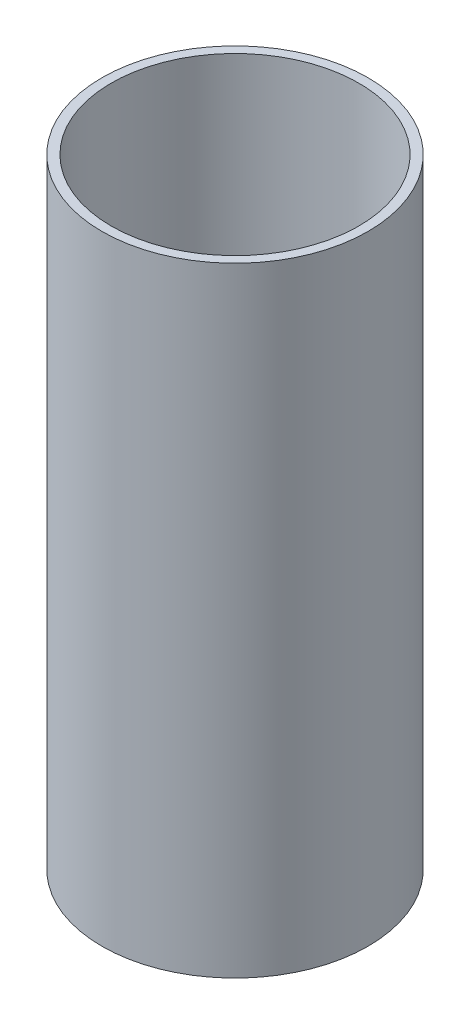
ISO-10303-21;
HEADER;
FILE_DESCRIPTION(('STEP AP214'),'2;1');
FILE_NAME('part.step','',(''),(''),'','','');
FILE_SCHEMA(('AUTOMOTIVE_DESIGN { 1 0 10303 214 1 1 1 1 }'));
ENDSEC;
DATA;
#1=APPLICATION_CONTEXT('core data for automotive mechanical design processes');
#2=APPLICATION_PROTOCOL_DEFINITION('international standard','automotive_design',2000,#1);
#3=PRODUCT_CONTEXT('',#1,'mechanical');
#4=PRODUCT('Part','Part','',(#3));
#5=PRODUCT_RELATED_PRODUCT_CATEGORY('part','',(#4));
#6=PRODUCT_DEFINITION_FORMATION('','',#4);
#7=PRODUCT_DEFINITION_CONTEXT('part definition',#1,'design');
#8=PRODUCT_DEFINITION('design','',#6,#7);
#9=PRODUCT_DEFINITION_SHAPE('','',#8);
#10=(LENGTH_UNIT() NAMED_UNIT(*) SI_UNIT(.MILLI.,.METRE.));
#11=(NAMED_UNIT(*) PLANE_ANGLE_UNIT() SI_UNIT($,.RADIAN.));
#12=(NAMED_UNIT(*) SI_UNIT($,.STERADIAN.) SOLID_ANGLE_UNIT());
#13=UNCERTAINTY_MEASURE_WITH_UNIT(LENGTH_MEASURE(1.E-05),#10,'distance_accuracy_value','');
#14=(GEOMETRIC_REPRESENTATION_CONTEXT(3) GLOBAL_UNCERTAINTY_ASSIGNED_CONTEXT((#13)) GLOBAL_UNIT_ASSIGNED_CONTEXT((#10,
#11,#12)) REPRESENTATION_CONTEXT('',''));
#15=CARTESIAN_POINT('',(0.,0.,0.));
#16=DIRECTION('',(0.,0.,1.));
#17=DIRECTION('',(1.,0.,0.));
#18=AXIS2_PLACEMENT_3D('',#15,#16,#17);
#19=CARTESIAN_POINT('',(0.,127.,0.));
#20=DIRECTION('',(0.,1.,0.));
#21=DIRECTION('',(0.,0.,1.));
#22=AXIS2_PLACEMENT_3D('',#19,#20,#21);
#23=PLANE('',#22);
#24=CARTESIAN_POINT('',(0.,127.,0.));
#25=DIRECTION('',(0.,1.,0.));
#26=DIRECTION('',(0.,0.,1.));
#27=AXIS2_PLACEMENT_3D('',#24,#25,#26);
#28=CIRCLE('',#27,27.305);
#29=CARTESIAN_POINT('',(0.,127.,27.305));
#30=VERTEX_POINT('',#29);
#31=EDGE_CURVE('E10',#30,#30,#28,.T.);
#32=ORIENTED_EDGE('',*,*,#31,.T.);
#33=EDGE_LOOP('',(#32));
#34=FACE_BOUND('',#33,.T.);
#35=CARTESIAN_POINT('',(0.,127.,0.));
#36=DIRECTION('',(0.,1.,0.));
#37=DIRECTION('',(0.,0.,1.));
#38=AXIS2_PLACEMENT_3D('',#35,#36,#37);
#39=CIRCLE('',#38,25.4);
#40=CARTESIAN_POINT('',(0.,127.,25.4));
#41=VERTEX_POINT('',#40);
#42=EDGE_CURVE('E45',#41,#41,#39,.T.);
#43=ORIENTED_EDGE('',*,*,#42,.F.);
#44=EDGE_LOOP('',(#43));
#45=FACE_BOUND('',#44,.T.);
#46=ADVANCED_FACE('F34',(#34,#45),#23,.T.);
#47=CARTESIAN_POINT('',(0.,0.,0.));
#48=DIRECTION('',(0.,1.,0.));
#49=DIRECTION('',(0.,0.,1.));
#50=AXIS2_PLACEMENT_3D('',#47,#48,#49);
#51=PLANE('',#50);
#52=CARTESIAN_POINT('',(0.,0.,0.));
#53=DIRECTION('',(0.,1.,0.));
#54=DIRECTION('',(0.,0.,1.));
#55=AXIS2_PLACEMENT_3D('',#52,#53,#54);
#56=CIRCLE('',#55,27.305);
#57=CARTESIAN_POINT('',(0.,0.,27.305));
#58=VERTEX_POINT('',#57);
#59=EDGE_CURVE('E38',#58,#58,#56,.T.);
#60=ORIENTED_EDGE('',*,*,#59,.F.);
#61=EDGE_LOOP('',(#60));
#62=FACE_BOUND('',#61,.T.);
#63=CARTESIAN_POINT('',(0.,0.,0.));
#64=DIRECTION('',(0.,1.,0.));
#65=DIRECTION('',(0.,0.,1.));
#66=AXIS2_PLACEMENT_3D('',#63,#64,#65);
#67=CIRCLE('',#66,25.4);
#68=CARTESIAN_POINT('',(0.,0.,25.4));
#69=VERTEX_POINT('',#68);
#70=EDGE_CURVE('E47',#69,#69,#67,.T.);
#71=ORIENTED_EDGE('',*,*,#70,.T.);
#72=EDGE_LOOP('',(#71));
#73=FACE_BOUND('',#72,.T.);
#74=ADVANCED_FACE('F57',(#62,#73),#51,.F.);
#75=CARTESIAN_POINT('',(0.,127.,0.));
#76=DIRECTION('',(0.,-1.,0.));
#77=DIRECTION('',(0.,0.,-1.));
#78=AXIS2_PLACEMENT_3D('',#75,#76,#77);
#79=CYLINDRICAL_SURFACE('',#78,27.305);
#80=ORIENTED_EDGE('',*,*,#31,.F.);
#81=EDGE_LOOP('',(#80));
#82=FACE_BOUND('',#81,.T.);
#83=ORIENTED_EDGE('',*,*,#59,.T.);
#84=EDGE_LOOP('',(#83));
#85=FACE_BOUND('',#84,.T.);
#86=ADVANCED_FACE('F36',(#82,#85),#79,.T.);
#87=CARTESIAN_POINT('',(0.,127.,0.));
#88=DIRECTION('',(0.,-1.,0.));
#89=DIRECTION('',(0.,0.,-1.));
#90=AXIS2_PLACEMENT_3D('',#87,#88,#89);
#91=CYLINDRICAL_SURFACE('',#90,25.4);
#92=ORIENTED_EDGE('',*,*,#42,.T.);
#93=EDGE_LOOP('',(#92));
#94=FACE_BOUND('',#93,.T.);
#95=ORIENTED_EDGE('',*,*,#70,.F.);
#96=EDGE_LOOP('',(#95));
#97=FACE_BOUND('',#96,.T.);
#98=ADVANCED_FACE('F53',(#94,#97),#91,.F.);
#99=CLOSED_SHELL('',(#46,#74,#86,#98));
#100=MANIFOLD_SOLID_BREP('B2',#99);
#101=ADVANCED_BREP_SHAPE_REPRESENTATION('',(#18,#100),#14);
#102=SHAPE_DEFINITION_REPRESENTATION(#9,#101);
ENDSEC;
END-ISO-10303-21;
